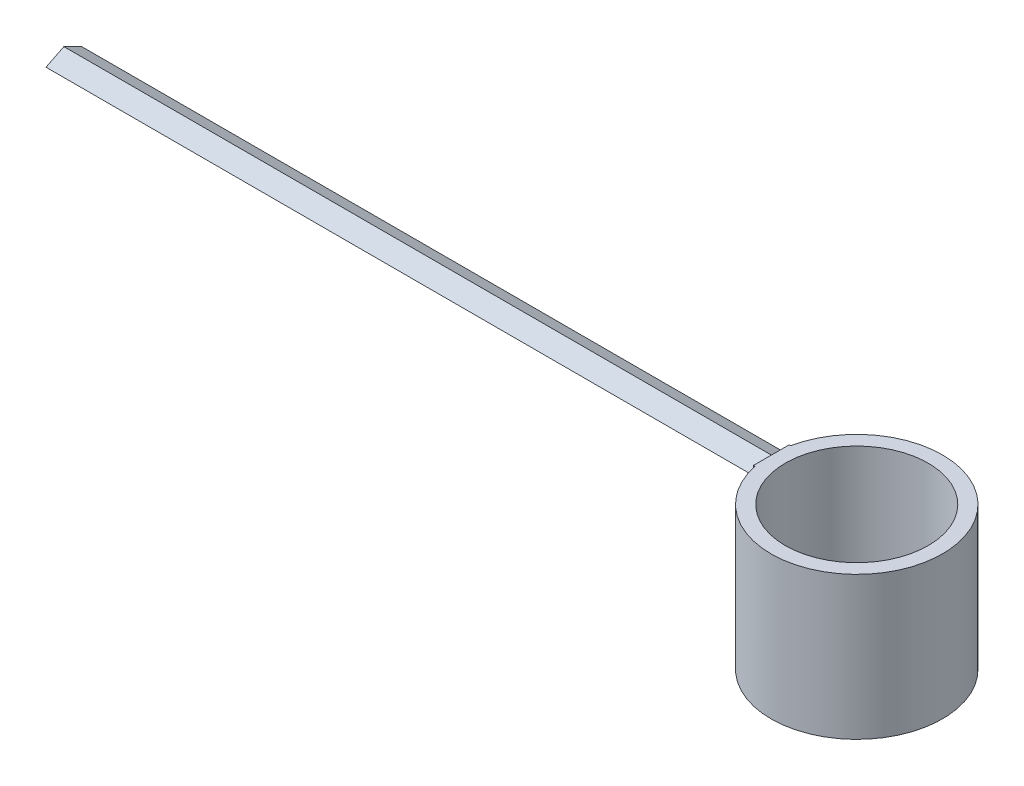
ISO-10303-21;
HEADER;
FILE_DESCRIPTION(('STEP AP214'),'2;1');
FILE_NAME('part.step','',(''),(''),'','','');
FILE_SCHEMA(('AUTOMOTIVE_DESIGN { 1 0 10303 214 1 1 1 1 }'));
ENDSEC;
DATA;
#1=APPLICATION_CONTEXT('core data for automotive mechanical design processes');
#2=APPLICATION_PROTOCOL_DEFINITION('international standard','automotive_design',2000,#1);
#3=PRODUCT_CONTEXT('',#1,'mechanical');
#4=PRODUCT('Part','Part','',(#3));
#5=PRODUCT_RELATED_PRODUCT_CATEGORY('part','',(#4));
#6=PRODUCT_DEFINITION_FORMATION('','',#4);
#7=PRODUCT_DEFINITION_CONTEXT('part definition',#1,'design');
#8=PRODUCT_DEFINITION('design','',#6,#7);
#9=PRODUCT_DEFINITION_SHAPE('','',#8);
#10=(LENGTH_UNIT() NAMED_UNIT(*) SI_UNIT(.MILLI.,.METRE.));
#11=(NAMED_UNIT(*) PLANE_ANGLE_UNIT() SI_UNIT($,.RADIAN.));
#12=(NAMED_UNIT(*) SI_UNIT($,.STERADIAN.) SOLID_ANGLE_UNIT());
#13=UNCERTAINTY_MEASURE_WITH_UNIT(LENGTH_MEASURE(1.E-05),#10,'distance_accuracy_value','');
#14=(GEOMETRIC_REPRESENTATION_CONTEXT(3) GLOBAL_UNCERTAINTY_ASSIGNED_CONTEXT((#13)) GLOBAL_UNIT_ASSIGNED_CONTEXT((#10,
#11,#12)) REPRESENTATION_CONTEXT('',''));
#15=CARTESIAN_POINT('',(0.,0.,0.));
#16=DIRECTION('',(0.,0.,1.));
#17=DIRECTION('',(1.,0.,0.));
#18=AXIS2_PLACEMENT_3D('',#15,#16,#17);
#19=CARTESIAN_POINT('',(0.,2.,0.));
#20=DIRECTION('',(0.,1.,0.));
#21=DIRECTION('',(0.,0.,1.));
#22=AXIS2_PLACEMENT_3D('',#19,#20,#21);
#23=PLANE('',#22);
#24=CARTESIAN_POINT('',(0.,2.,0.));
#25=DIRECTION('',(0.,1.,0.));
#26=DIRECTION('',(0.,0.,1.));
#27=AXIS2_PLACEMENT_3D('',#24,#25,#26);
#28=CIRCLE('',#27,1.);
#29=CARTESIAN_POINT('',(0.,2.,1.));
#30=VERTEX_POINT('',#29);
#31=EDGE_CURVE('E142',#30,#30,#28,.T.);
#32=ORIENTED_EDGE('',*,*,#31,.F.);
#33=EDGE_LOOP('',(#32));
#34=FACE_BOUND('',#33,.T.);
#35=DIRECTION('',(-1.,0.,0.));
#36=VECTOR('',#35,1.);
#37=CARTESIAN_POINT('',(0.,2.,-0.250000000000004));
#38=LINE('',#37,#36);
#39=CARTESIAN_POINT('',(-1.17366945943055,2.,-0.250000000000003));
#40=VERTEX_POINT('',#39);
#41=CARTESIAN_POINT('',(-1.19470633122011,2.,-0.250000000000001));
#42=VERTEX_POINT('',#41);
#43=EDGE_CURVE('E119',#40,#42,#38,.T.);
#44=ORIENTED_EDGE('',*,*,#43,.T.);
#45=DIRECTION('',(0.,0.,1.));
#46=VECTOR('',#45,1.);
#47=CARTESIAN_POINT('',(-1.19470633122011,2.,0.));
#48=LINE('',#47,#46);
#49=CARTESIAN_POINT('',(-1.19470633122011,2.,0.));
#50=VERTEX_POINT('',#49);
#51=EDGE_CURVE('E173',#42,#50,#48,.T.);
#52=ORIENTED_EDGE('',*,*,#51,.T.);
#53=CARTESIAN_POINT('',(-1.19470633122011,2.,0.249999999999997));
#54=VERTEX_POINT('',#53);
#55=EDGE_CURVE('E116',#50,#54,#48,.T.);
#56=ORIENTED_EDGE('',*,*,#55,.T.);
#57=DIRECTION('',(1.,0.,0.));
#58=VECTOR('',#57,1.);
#59=CARTESIAN_POINT('',(0.,2.,0.249999999999997));
#60=LINE('',#59,#58);
#61=CARTESIAN_POINT('',(-1.17366945943055,2.,0.249999999999997));
#62=VERTEX_POINT('',#61);
#63=EDGE_CURVE('E110',#54,#62,#60,.T.);
#64=ORIENTED_EDGE('',*,*,#63,.T.);
#65=CARTESIAN_POINT('',(0.,2.,0.));
#66=DIRECTION('',(0.,1.,0.));
#67=DIRECTION('',(0.,0.,1.));
#68=AXIS2_PLACEMENT_3D('',#65,#66,#67);
#69=CIRCLE('',#68,1.2);
#70=EDGE_CURVE('E114',#62,#40,#69,.T.);
#71=ORIENTED_EDGE('',*,*,#70,.T.);
#72=EDGE_LOOP('',(#44,#52,#56,#64,#71));
#73=FACE_BOUND('',#72,.T.);
#74=ADVANCED_FACE('F42',(#34,#73),#23,.T.);
#75=CARTESIAN_POINT('',(0.,0.,0.));
#76=DIRECTION('',(0.,1.,0.));
#77=DIRECTION('',(0.,0.,1.));
#78=AXIS2_PLACEMENT_3D('',#75,#76,#77);
#79=PLANE('',#78);
#80=CARTESIAN_POINT('',(0.,0.,0.));
#81=DIRECTION('',(0.,1.,0.));
#82=DIRECTION('',(0.,0.,1.));
#83=AXIS2_PLACEMENT_3D('',#80,#81,#82);
#84=CIRCLE('',#83,1.);
#85=CARTESIAN_POINT('',(0.,0.,1.));
#86=VERTEX_POINT('',#85);
#87=EDGE_CURVE('E145',#86,#86,#84,.T.);
#88=ORIENTED_EDGE('',*,*,#87,.T.);
#89=EDGE_LOOP('',(#88));
#90=FACE_BOUND('',#89,.T.);
#91=DIRECTION('',(0.,0.,1.));
#92=VECTOR('',#91,1.);
#93=CARTESIAN_POINT('',(-1.19470633122011,0.,0.));
#94=LINE('',#93,#92);
#95=CARTESIAN_POINT('',(-1.19470633122011,0.,-0.112591216986875));
#96=VERTEX_POINT('',#95);
#97=CARTESIAN_POINT('',(-1.19470633122011,0.,0.112591216986875));
#98=VERTEX_POINT('',#97);
#99=EDGE_CURVE('E46',#96,#98,#94,.T.);
#100=ORIENTED_EDGE('',*,*,#99,.F.);
#101=CARTESIAN_POINT('',(0.,0.,0.));
#102=DIRECTION('',(0.,1.,0.));
#103=DIRECTION('',(0.,0.,1.));
#104=AXIS2_PLACEMENT_3D('',#101,#102,#103);
#105=CIRCLE('',#104,1.2);
#106=EDGE_CURVE('E137',#98,#96,#105,.T.);
#107=ORIENTED_EDGE('',*,*,#106,.F.);
#108=EDGE_LOOP('',(#100,#107));
#109=FACE_BOUND('',#108,.T.);
#110=ADVANCED_FACE('F278',(#90,#109),#79,.F.);
#111=CARTESIAN_POINT('',(0.,2.,0.));
#112=DIRECTION('',(0.,-1.,0.));
#113=DIRECTION('',(0.,0.,-1.));
#114=AXIS2_PLACEMENT_3D('',#111,#112,#113);
#115=CYLINDRICAL_SURFACE('',#114,1.2);
#116=DIRECTION('',(0.,-1.,0.));
#117=VECTOR('',#116,1.);
#118=CARTESIAN_POINT('',(-1.19470633122011,2.,-0.112591216986875));
#119=LINE('',#118,#117);
#120=CARTESIAN_POINT('',(-1.19470633122011,1.75,-0.112591216986875));
#121=VERTEX_POINT('',#120);
#122=EDGE_CURVE('E73',#121,#96,#119,.T.);
#123=ORIENTED_EDGE('',*,*,#122,.F.);
#124=CARTESIAN_POINT('',(0.,1.75,0.));
#125=DIRECTION('',(0.,1.,0.));
#126=DIRECTION('',(0.,0.,1.));
#127=AXIS2_PLACEMENT_3D('',#124,#125,#126);
#128=CIRCLE('',#127,1.2);
#129=CARTESIAN_POINT('',(-1.17366945943055,1.75,-0.250000000000003));
#130=VERTEX_POINT('',#129);
#131=EDGE_CURVE('E159',#130,#121,#128,.T.);
#132=ORIENTED_EDGE('',*,*,#131,.F.);
#133=DIRECTION('',(0.,1.,0.));
#134=VECTOR('',#133,1.);
#135=CARTESIAN_POINT('',(-1.17366945943055,1.75,-0.250000000000003));
#136=LINE('',#135,#134);
#137=EDGE_CURVE('E131',#130,#40,#136,.T.);
#138=ORIENTED_EDGE('',*,*,#137,.T.);
#139=ORIENTED_EDGE('',*,*,#70,.F.);
#140=DIRECTION('',(0.,1.,0.));
#141=VECTOR('',#140,1.);
#142=CARTESIAN_POINT('',(-1.17366945943055,1.75,0.249999999999997));
#143=LINE('',#142,#141);
#144=CARTESIAN_POINT('',(-1.17366945943055,1.75,0.249999999999997));
#145=VERTEX_POINT('',#144);
#146=EDGE_CURVE('E122',#145,#62,#143,.T.);
#147=ORIENTED_EDGE('',*,*,#146,.F.);
#148=CARTESIAN_POINT('',(-1.19470633122011,1.75,0.112591216986875));
#149=VERTEX_POINT('',#148);
#150=EDGE_CURVE('E163',#149,#145,#128,.T.);
#151=ORIENTED_EDGE('',*,*,#150,.F.);
#152=DIRECTION('',(0.,-1.,0.));
#153=VECTOR('',#152,1.);
#154=CARTESIAN_POINT('',(-1.19470633122011,2.,0.112591216986875));
#155=LINE('',#154,#153);
#156=EDGE_CURVE('E176',#98,#149,#155,.F.);
#157=ORIENTED_EDGE('',*,*,#156,.F.);
#158=ORIENTED_EDGE('',*,*,#106,.T.);
#159=EDGE_LOOP('',(#123,#132,#138,#139,#147,#151,#157,#158));
#160=FACE_BOUND('',#159,.T.);
#161=ADVANCED_FACE('F44',(#160),#115,.T.);
#162=CARTESIAN_POINT('',(0.,1.75,-0.250000000000004));
#163=DIRECTION('',(0.,0.,-1.));
#164=DIRECTION('',(-1.,0.,0.));
#165=AXIS2_PLACEMENT_3D('',#162,#163,#164);
#166=PLANE('',#165);
#167=DIRECTION('',(-1.,0.,0.));
#168=VECTOR('',#167,1.);
#169=CARTESIAN_POINT('',(0.,1.75,-0.250000000000004));
#170=LINE('',#169,#168);
#171=CARTESIAN_POINT('',(-1.19470633122011,1.75,-0.250000000000003));
#172=VERTEX_POINT('',#171);
#173=EDGE_CURVE('E132',#130,#172,#170,.T.);
#174=ORIENTED_EDGE('',*,*,#173,.T.);
#175=DIRECTION('',(0.,1.,0.));
#176=VECTOR('',#175,1.);
#177=CARTESIAN_POINT('',(-1.19470633122011,1.75,-0.250000000000003));
#178=LINE('',#177,#176);
#179=CARTESIAN_POINT('',(-1.19470633122011,1.875,-0.250000000000003));
#180=VERTEX_POINT('',#179);
#181=EDGE_CURVE('E168',#172,#180,#178,.T.);
#182=ORIENTED_EDGE('',*,*,#181,.T.);
#183=EDGE_CURVE('E169',#180,#42,#178,.T.);
#184=ORIENTED_EDGE('',*,*,#183,.T.);
#185=ORIENTED_EDGE('',*,*,#43,.F.);
#186=ORIENTED_EDGE('',*,*,#137,.F.);
#187=EDGE_LOOP('',(#174,#182,#184,#185,#186));
#188=FACE_BOUND('',#187,.T.);
#189=ADVANCED_FACE('F252',(#188),#166,.T.);
#190=CARTESIAN_POINT('',(0.,1.75,0.249999999999997));
#191=DIRECTION('',(0.,0.,1.));
#192=DIRECTION('',(1.,0.,0.));
#193=AXIS2_PLACEMENT_3D('',#190,#191,#192);
#194=PLANE('',#193);
#195=ORIENTED_EDGE('',*,*,#63,.F.);
#196=DIRECTION('',(0.,-1.,0.));
#197=VECTOR('',#196,1.);
#198=CARTESIAN_POINT('',(-1.19470633122011,1.75,0.249999999999997));
#199=LINE('',#198,#197);
#200=CARTESIAN_POINT('',(-1.19470633122011,1.875,0.249999999999997));
#201=VERTEX_POINT('',#200);
#202=EDGE_CURVE('E87',#54,#201,#199,.T.);
#203=ORIENTED_EDGE('',*,*,#202,.T.);
#204=CARTESIAN_POINT('',(-1.19470633122011,1.75,0.25));
#205=VERTEX_POINT('',#204);
#206=EDGE_CURVE('E179',#201,#205,#199,.T.);
#207=ORIENTED_EDGE('',*,*,#206,.T.);
#208=DIRECTION('',(1.,0.,0.));
#209=VECTOR('',#208,1.);
#210=CARTESIAN_POINT('',(0.,1.75,0.249999999999997));
#211=LINE('',#210,#209);
#212=EDGE_CURVE('E126',#205,#145,#211,.T.);
#213=ORIENTED_EDGE('',*,*,#212,.T.);
#214=ORIENTED_EDGE('',*,*,#146,.T.);
#215=EDGE_LOOP('',(#195,#203,#207,#213,#214));
#216=FACE_BOUND('',#215,.T.);
#217=ADVANCED_FACE('F123',(#216),#194,.T.);
#218=CARTESIAN_POINT('',(0.,1.75,0.));
#219=DIRECTION('',(0.,1.,0.));
#220=DIRECTION('',(0.,0.,1.));
#221=AXIS2_PLACEMENT_3D('',#218,#219,#220);
#222=PLANE('',#221);
#223=DIRECTION('',(0.,0.,1.));
#224=VECTOR('',#223,1.);
#225=CARTESIAN_POINT('',(-1.19470633122011,1.75,0.));
#226=LINE('',#225,#224);
#227=EDGE_CURVE('E12',#172,#121,#226,.T.);
#228=ORIENTED_EDGE('',*,*,#227,.F.);
#229=ORIENTED_EDGE('',*,*,#173,.F.);
#230=ORIENTED_EDGE('',*,*,#131,.T.);
#231=EDGE_LOOP('',(#228,#229,#230));
#232=FACE_BOUND('',#231,.T.);
#233=ADVANCED_FACE('F296',(#232),#222,.F.);
#234=EDGE_CURVE('E53',#149,#205,#226,.T.);
#235=ORIENTED_EDGE('',*,*,#234,.F.);
#236=ORIENTED_EDGE('',*,*,#150,.T.);
#237=ORIENTED_EDGE('',*,*,#212,.F.);
#238=EDGE_LOOP('',(#235,#236,#237));
#239=FACE_BOUND('',#238,.T.);
#240=ADVANCED_FACE('F288',(#239),#222,.F.);
#241=CARTESIAN_POINT('',(0.,2.,0.));
#242=DIRECTION('',(0.,-1.,0.));
#243=DIRECTION('',(0.,0.,-1.));
#244=AXIS2_PLACEMENT_3D('',#241,#242,#243);
#245=CYLINDRICAL_SURFACE('',#244,1.);
#246=ORIENTED_EDGE('',*,*,#31,.T.);
#247=EDGE_LOOP('',(#246));
#248=FACE_BOUND('',#247,.T.);
#249=ORIENTED_EDGE('',*,*,#87,.F.);
#250=EDGE_LOOP('',(#249));
#251=FACE_BOUND('',#250,.T.);
#252=ADVANCED_FACE('F286',(#248,#251),#245,.F.);
#253=CARTESIAN_POINT('',(-1.19470633122011,1.,0.));
#254=DIRECTION('',(-1.,0.,0.));
#255=DIRECTION('',(0.,0.,1.));
#256=AXIS2_PLACEMENT_3D('',#253,#254,#255);
#257=PLANE('',#256);
#258=ORIENTED_EDGE('',*,*,#227,.T.);
#259=ORIENTED_EDGE('',*,*,#122,.T.);
#260=ORIENTED_EDGE('',*,*,#99,.T.);
#261=ORIENTED_EDGE('',*,*,#156,.T.);
#262=ORIENTED_EDGE('',*,*,#234,.T.);
#263=ORIENTED_EDGE('',*,*,#206,.F.);
#264=DIRECTION('',(0.,0.447213595499963,0.894427190999913));
#265=VECTOR('',#264,1.);
#266=CARTESIAN_POINT('',(-1.19470633122011,1.875,0.249999999999997));
#267=LINE('',#266,#265);
#268=CARTESIAN_POINT('',(-1.19470633122011,1.75,0.));
#269=VERTEX_POINT('',#268);
#270=EDGE_CURVE('E219',#269,#201,#267,.T.);
#271=ORIENTED_EDGE('',*,*,#270,.F.);
#272=DIRECTION('',(0.,-0.447213595499952,0.894427190999919));
#273=VECTOR('',#272,1.);
#274=CARTESIAN_POINT('',(-1.19470633122011,1.75,0.));
#275=LINE('',#274,#273);
#276=EDGE_CURVE('E201',#180,#269,#275,.T.);
#277=ORIENTED_EDGE('',*,*,#276,.F.);
#278=ORIENTED_EDGE('',*,*,#181,.F.);
#279=EDGE_LOOP('',(#258,#259,#260,#261,#262,#263,#271,#277,#278));
#280=FACE_BOUND('',#279,.T.);
#281=ADVANCED_FACE('F239',(#280),#257,.T.);
#282=DIRECTION('',(0.,-0.447213595499953,-0.894427190999918));
#283=VECTOR('',#282,1.);
#284=CARTESIAN_POINT('',(-1.19470633122011,1.875,-0.250000000000003));
#285=LINE('',#284,#283);
#286=EDGE_CURVE('E188',#50,#180,#285,.T.);
#287=ORIENTED_EDGE('',*,*,#286,.F.);
#288=ORIENTED_EDGE('',*,*,#51,.F.);
#289=ORIENTED_EDGE('',*,*,#183,.F.);
#290=EDGE_LOOP('',(#287,#288,#289));
#291=FACE_BOUND('',#290,.T.);
#292=ADVANCED_FACE('F294',(#291),#257,.T.);
#293=DIRECTION('',(0.,0.447213595499963,-0.894427190999913));
#294=VECTOR('',#293,1.);
#295=CARTESIAN_POINT('',(-1.19470633122011,2.,0.));
#296=LINE('',#295,#294);
#297=EDGE_CURVE('E215',#201,#50,#296,.T.);
#298=ORIENTED_EDGE('',*,*,#297,.F.);
#299=ORIENTED_EDGE('',*,*,#202,.F.);
#300=ORIENTED_EDGE('',*,*,#55,.F.);
#301=EDGE_LOOP('',(#298,#299,#300));
#302=FACE_BOUND('',#301,.T.);
#303=ADVANCED_FACE('F263',(#302),#257,.T.);
#304=CARTESIAN_POINT('',(-1.19470633122011,1.75,0.));
#305=DIRECTION('',(0.,-0.894427190999919,-0.447213595499952));
#306=DIRECTION('',(0.,0.447213595499952,-0.894427190999919));
#307=AXIS2_PLACEMENT_3D('',#304,#305,#306);
#308=PLANE('',#307);
#309=DIRECTION('',(0.,-0.447213595499952,0.894427190999919));
#310=VECTOR('',#309,1.);
#311=CARTESIAN_POINT('',(-11.0947063312201,1.75,0.));
#312=LINE('',#311,#310);
#313=CARTESIAN_POINT('',(-11.0947063312201,1.875,-0.250000000000003));
#314=VERTEX_POINT('',#313);
#315=CARTESIAN_POINT('',(-11.0947063312201,1.75,0.));
#316=VERTEX_POINT('',#315);
#317=EDGE_CURVE('E208',#314,#316,#312,.T.);
#318=ORIENTED_EDGE('',*,*,#317,.F.);
#319=DIRECTION('',(-1.,0.,0.));
#320=VECTOR('',#319,1.);
#321=CARTESIAN_POINT('',(-1.19470633122011,1.875,-0.250000000000003));
#322=LINE('',#321,#320);
#323=EDGE_CURVE('E182',#180,#314,#322,.T.);
#324=ORIENTED_EDGE('',*,*,#323,.F.);
#325=ORIENTED_EDGE('',*,*,#276,.T.);
#326=DIRECTION('',(-1.,0.,0.));
#327=VECTOR('',#326,1.);
#328=CARTESIAN_POINT('',(-1.19470633122011,1.75,0.));
#329=LINE('',#328,#327);
#330=EDGE_CURVE('E183',#269,#316,#329,.T.);
#331=ORIENTED_EDGE('',*,*,#330,.T.);
#332=EDGE_LOOP('',(#318,#324,#325,#331));
#333=FACE_BOUND('',#332,.T.);
#334=ADVANCED_FACE('F230',(#333),#308,.T.);
#335=CARTESIAN_POINT('',(-1.19470633122011,1.875,-0.250000000000003));
#336=DIRECTION('',(0.,0.894427190999918,-0.447213595499953));
#337=DIRECTION('',(0.,0.447213595499953,0.894427190999918));
#338=AXIS2_PLACEMENT_3D('',#335,#336,#337);
#339=PLANE('',#338);
#340=DIRECTION('',(0.,-0.447213595499953,-0.894427190999918));
#341=VECTOR('',#340,1.);
#342=CARTESIAN_POINT('',(-11.0947063312201,1.875,-0.250000000000003));
#343=LINE('',#342,#341);
#344=CARTESIAN_POINT('',(-11.0947063312201,2.,0.));
#345=VERTEX_POINT('',#344);
#346=EDGE_CURVE('E197',#345,#314,#343,.T.);
#347=ORIENTED_EDGE('',*,*,#346,.F.);
#348=DIRECTION('',(-1.,0.,0.));
#349=VECTOR('',#348,1.);
#350=CARTESIAN_POINT('',(-1.19470633122011,2.,0.));
#351=LINE('',#350,#349);
#352=EDGE_CURVE('E191',#50,#345,#351,.T.);
#353=ORIENTED_EDGE('',*,*,#352,.F.);
#354=ORIENTED_EDGE('',*,*,#286,.T.);
#355=ORIENTED_EDGE('',*,*,#323,.T.);
#356=EDGE_LOOP('',(#347,#353,#354,#355));
#357=FACE_BOUND('',#356,.T.);
#358=ADVANCED_FACE('F249',(#357),#339,.T.);
#359=CARTESIAN_POINT('',(-1.19470633122011,2.,0.));
#360=DIRECTION('',(0.,0.894427190999913,0.447213595499963));
#361=DIRECTION('',(0.,-0.447213595499963,0.894427190999913));
#362=AXIS2_PLACEMENT_3D('',#359,#360,#361);
#363=PLANE('',#362);
#364=DIRECTION('',(0.,0.447213595499963,-0.894427190999913));
#365=VECTOR('',#364,1.);
#366=CARTESIAN_POINT('',(-11.0947063312201,2.,0.));
#367=LINE('',#366,#365);
#368=CARTESIAN_POINT('',(-11.0947063312201,1.875,0.25));
#369=VERTEX_POINT('',#368);
#370=EDGE_CURVE('E61',#369,#345,#367,.T.);
#371=ORIENTED_EDGE('',*,*,#370,.F.);
#372=DIRECTION('',(-1.,0.,0.));
#373=VECTOR('',#372,1.);
#374=CARTESIAN_POINT('',(-1.19470633122011,1.875,0.249999999999997));
#375=LINE('',#374,#373);
#376=EDGE_CURVE('E187',#201,#369,#375,.T.);
#377=ORIENTED_EDGE('',*,*,#376,.F.);
#378=ORIENTED_EDGE('',*,*,#297,.T.);
#379=ORIENTED_EDGE('',*,*,#352,.T.);
#380=EDGE_LOOP('',(#371,#377,#378,#379));
#381=FACE_BOUND('',#380,.T.);
#382=ADVANCED_FACE('F264',(#381),#363,.T.);
#383=CARTESIAN_POINT('',(-1.19470633122011,1.875,0.249999999999997));
#384=DIRECTION('',(0.,-0.894427190999914,0.447213595499963));
#385=DIRECTION('',(0.,-0.447213595499963,-0.894427190999914));
#386=AXIS2_PLACEMENT_3D('',#383,#384,#385);
#387=PLANE('',#386);
#388=DIRECTION('',(0.,0.447213595499963,0.894427190999913));
#389=VECTOR('',#388,1.);
#390=CARTESIAN_POINT('',(-11.0947063312201,1.875,0.249999999999997));
#391=LINE('',#390,#389);
#392=EDGE_CURVE('E204',#316,#369,#391,.T.);
#393=ORIENTED_EDGE('',*,*,#392,.F.);
#394=ORIENTED_EDGE('',*,*,#330,.F.);
#395=ORIENTED_EDGE('',*,*,#270,.T.);
#396=ORIENTED_EDGE('',*,*,#376,.T.);
#397=EDGE_LOOP('',(#393,#394,#395,#396));
#398=FACE_BOUND('',#397,.T.);
#399=ADVANCED_FACE('F266',(#398),#387,.T.);
#400=CARTESIAN_POINT('',(-11.0947063312201,1.75,0.));
#401=DIRECTION('',(-1.,0.,0.));
#402=DIRECTION('',(0.,0.,1.));
#403=AXIS2_PLACEMENT_3D('',#400,#401,#402);
#404=PLANE('',#403);
#405=ORIENTED_EDGE('',*,*,#346,.T.);
#406=ORIENTED_EDGE('',*,*,#317,.T.);
#407=ORIENTED_EDGE('',*,*,#392,.T.);
#408=ORIENTED_EDGE('',*,*,#370,.T.);
#409=EDGE_LOOP('',(#405,#406,#407,#408));
#410=FACE_BOUND('',#409,.T.);
#411=ADVANCED_FACE('F268',(#410),#404,.T.);
#412=CLOSED_SHELL('',(#74,#110,#161,#189,#217,#233,#240,#252,#281,#292,#303,#334,#358,#382,#399,#411));
#413=MANIFOLD_SOLID_BREP('B2',#412);
#414=ADVANCED_BREP_SHAPE_REPRESENTATION('',(#18,#413),#14);
#415=SHAPE_DEFINITION_REPRESENTATION(#9,#414);
ENDSEC;
END-ISO-10303-21;
